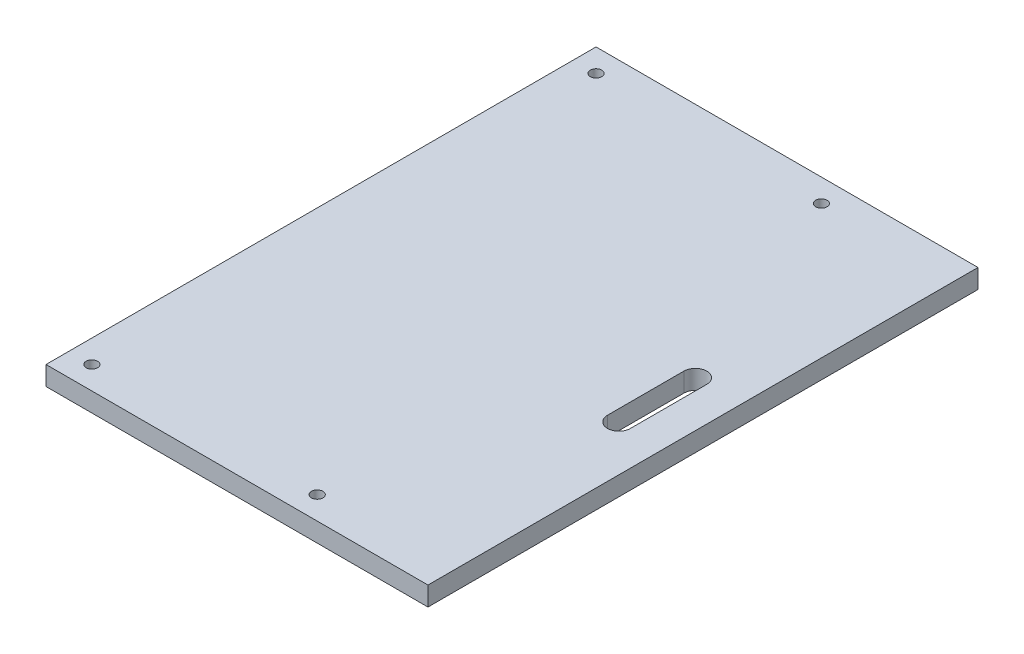
ISO-10303-21;
HEADER;
FILE_DESCRIPTION(('STEP AP214'),'2;1');
FILE_NAME('part.step','',(''),(''),'','','');
FILE_SCHEMA(('AUTOMOTIVE_DESIGN { 1 0 10303 214 1 1 1 1 }'));
ENDSEC;
DATA;
#1=APPLICATION_CONTEXT('core data for automotive mechanical design processes');
#2=APPLICATION_PROTOCOL_DEFINITION('international standard','automotive_design',2000,#1);
#3=PRODUCT_CONTEXT('',#1,'mechanical');
#4=PRODUCT('Part','Part','',(#3));
#5=PRODUCT_RELATED_PRODUCT_CATEGORY('part','',(#4));
#6=PRODUCT_DEFINITION_FORMATION('','',#4);
#7=PRODUCT_DEFINITION_CONTEXT('part definition',#1,'design');
#8=PRODUCT_DEFINITION('design','',#6,#7);
#9=PRODUCT_DEFINITION_SHAPE('','',#8);
#10=(LENGTH_UNIT() NAMED_UNIT(*) SI_UNIT(.MILLI.,.METRE.));
#11=(NAMED_UNIT(*) PLANE_ANGLE_UNIT() SI_UNIT($,.RADIAN.));
#12=(NAMED_UNIT(*) SI_UNIT($,.STERADIAN.) SOLID_ANGLE_UNIT());
#13=UNCERTAINTY_MEASURE_WITH_UNIT(LENGTH_MEASURE(1.E-05),#10,'distance_accuracy_value','');
#14=(GEOMETRIC_REPRESENTATION_CONTEXT(3) GLOBAL_UNCERTAINTY_ASSIGNED_CONTEXT((#13)) GLOBAL_UNIT_ASSIGNED_CONTEXT((#10,
#11,#12)) REPRESENTATION_CONTEXT('',''));
#15=CARTESIAN_POINT('',(0.,0.,0.));
#16=DIRECTION('',(0.,0.,1.));
#17=DIRECTION('',(1.,0.,0.));
#18=AXIS2_PLACEMENT_3D('',#15,#16,#17);
#19=CARTESIAN_POINT('',(0.,5.,0.));
#20=DIRECTION('',(0.,-1.,0.));
#21=DIRECTION('',(0.,0.,-1.));
#22=AXIS2_PLACEMENT_3D('',#19,#20,#21);
#23=PLANE('',#22);
#24=CARTESIAN_POINT('',(65.,5.,-6.));
#25=DIRECTION('',(0.,1.,0.));
#26=DIRECTION('',(0.,0.,1.));
#27=AXIS2_PLACEMENT_3D('',#24,#25,#26);
#28=CIRCLE('',#27,1.5);
#29=CARTESIAN_POINT('',(65.,5.,-4.5));
#30=VERTEX_POINT('',#29);
#31=EDGE_CURVE('E237',#30,#30,#28,.T.);
#32=ORIENTED_EDGE('',*,*,#31,.F.);
#33=EDGE_LOOP('',(#32));
#34=FACE_BOUND('',#33,.T.);
#35=CARTESIAN_POINT('',(65.,5.,-138.));
#36=DIRECTION('',(0.,1.,0.));
#37=DIRECTION('',(0.,0.,1.));
#38=AXIS2_PLACEMENT_3D('',#35,#36,#37);
#39=CIRCLE('',#38,1.5);
#40=CARTESIAN_POINT('',(65.,5.,-136.5));
#41=VERTEX_POINT('',#40);
#42=EDGE_CURVE('E239',#41,#41,#39,.T.);
#43=ORIENTED_EDGE('',*,*,#42,.F.);
#44=EDGE_LOOP('',(#43));
#45=FACE_BOUND('',#44,.T.);
#46=CARTESIAN_POINT('',(6.,5.,-6.));
#47=DIRECTION('',(0.,1.,0.));
#48=DIRECTION('',(0.,0.,1.));
#49=AXIS2_PLACEMENT_3D('',#46,#47,#48);
#50=CIRCLE('',#49,1.5);
#51=CARTESIAN_POINT('',(6.,5.,-4.5));
#52=VERTEX_POINT('',#51);
#53=EDGE_CURVE('E245',#52,#52,#50,.T.);
#54=ORIENTED_EDGE('',*,*,#53,.F.);
#55=EDGE_LOOP('',(#54));
#56=FACE_BOUND('',#55,.T.);
#57=CARTESIAN_POINT('',(6.,5.,-138.));
#58=DIRECTION('',(0.,1.,0.));
#59=DIRECTION('',(0.,0.,1.));
#60=AXIS2_PLACEMENT_3D('',#57,#58,#59);
#61=CIRCLE('',#60,1.5);
#62=CARTESIAN_POINT('',(6.,5.,-136.5));
#63=VERTEX_POINT('',#62);
#64=EDGE_CURVE('E251',#63,#63,#61,.T.);
#65=ORIENTED_EDGE('',*,*,#64,.F.);
#66=EDGE_LOOP('',(#65));
#67=FACE_BOUND('',#66,.T.);
#68=DIRECTION('',(0.,0.,1.));
#69=VECTOR('',#68,1.);
#70=CARTESIAN_POINT('',(0.,5.,0.));
#71=LINE('',#70,#69);
#72=CARTESIAN_POINT('',(0.,5.,-144.));
#73=VERTEX_POINT('',#72);
#74=CARTESIAN_POINT('',(0.,5.,0.));
#75=VERTEX_POINT('',#74);
#76=EDGE_CURVE('E135',#73,#75,#71,.T.);
#77=ORIENTED_EDGE('',*,*,#76,.T.);
#78=DIRECTION('',(1.,0.,0.));
#79=VECTOR('',#78,1.);
#80=CARTESIAN_POINT('',(0.,5.,0.));
#81=LINE('',#80,#79);
#82=CARTESIAN_POINT('',(100.,5.,0.));
#83=VERTEX_POINT('',#82);
#84=EDGE_CURVE('E138',#75,#83,#81,.T.);
#85=ORIENTED_EDGE('',*,*,#84,.T.);
#86=DIRECTION('',(0.,0.,-1.));
#87=VECTOR('',#86,1.);
#88=CARTESIAN_POINT('',(100.,5.,0.));
#89=LINE('',#88,#87);
#90=CARTESIAN_POINT('',(100.,5.,-144.));
#91=VERTEX_POINT('',#90);
#92=EDGE_CURVE('E141',#83,#91,#89,.T.);
#93=ORIENTED_EDGE('',*,*,#92,.T.);
#94=DIRECTION('',(-1.,0.,0.));
#95=VECTOR('',#94,1.);
#96=CARTESIAN_POINT('',(0.,5.,-144.));
#97=LINE('',#96,#95);
#98=EDGE_CURVE('E143',#91,#73,#97,.T.);
#99=ORIENTED_EDGE('',*,*,#98,.T.);
#100=EDGE_LOOP('',(#77,#85,#93,#99));
#101=FACE_BOUND('',#100,.T.);
#102=CARTESIAN_POINT('',(88.,5.,-82.));
#103=DIRECTION('',(0.,1.,0.));
#104=DIRECTION('',(0.,0.,1.));
#105=AXIS2_PLACEMENT_3D('',#102,#103,#104);
#106=CIRCLE('',#105,3.);
#107=CARTESIAN_POINT('',(91.,5.,-82.));
#108=VERTEX_POINT('',#107);
#109=CARTESIAN_POINT('',(85.,5.,-82.));
#110=VERTEX_POINT('',#109);
#111=EDGE_CURVE('E97',#108,#110,#106,.T.);
#112=ORIENTED_EDGE('',*,*,#111,.F.);
#113=DIRECTION('',(0.,0.,-1.));
#114=VECTOR('',#113,1.);
#115=CARTESIAN_POINT('',(91.,5.,-82.));
#116=LINE('',#115,#114);
#117=CARTESIAN_POINT('',(91.,5.,-62.));
#118=VERTEX_POINT('',#117);
#119=EDGE_CURVE('E119',#118,#108,#116,.T.);
#120=ORIENTED_EDGE('',*,*,#119,.F.);
#121=CARTESIAN_POINT('',(88.,5.,-62.));
#122=DIRECTION('',(0.,1.,0.));
#123=DIRECTION('',(0.,0.,-1.));
#124=AXIS2_PLACEMENT_3D('',#121,#122,#123);
#125=CIRCLE('',#124,3.);
#126=CARTESIAN_POINT('',(85.,5.,-62.));
#127=VERTEX_POINT('',#126);
#128=EDGE_CURVE('E117',#127,#118,#125,.T.);
#129=ORIENTED_EDGE('',*,*,#128,.F.);
#130=DIRECTION('',(0.,0.,1.));
#131=VECTOR('',#130,1.);
#132=CARTESIAN_POINT('',(85.,5.,-82.));
#133=LINE('',#132,#131);
#134=EDGE_CURVE('E105',#110,#127,#133,.T.);
#135=ORIENTED_EDGE('',*,*,#134,.F.);
#136=EDGE_LOOP('',(#112,#120,#129,#135));
#137=FACE_BOUND('',#136,.T.);
#138=ADVANCED_FACE('F32',(#34,#45,#56,#67,#101,#137),#23,.F.);
#139=CARTESIAN_POINT('',(0.,0.,0.));
#140=DIRECTION('',(0.,-1.,0.));
#141=DIRECTION('',(0.,0.,-1.));
#142=AXIS2_PLACEMENT_3D('',#139,#140,#141);
#143=PLANE('',#142);
#144=CARTESIAN_POINT('',(65.,0.,-6.));
#145=DIRECTION('',(0.,1.,0.));
#146=DIRECTION('',(0.,0.,1.));
#147=AXIS2_PLACEMENT_3D('',#144,#145,#146);
#148=CIRCLE('',#147,1.5);
#149=CARTESIAN_POINT('',(65.,0.,-4.5));
#150=VERTEX_POINT('',#149);
#151=EDGE_CURVE('E235',#150,#150,#148,.T.);
#152=ORIENTED_EDGE('',*,*,#151,.T.);
#153=EDGE_LOOP('',(#152));
#154=FACE_BOUND('',#153,.T.);
#155=CARTESIAN_POINT('',(65.,0.,-138.));
#156=DIRECTION('',(0.,1.,0.));
#157=DIRECTION('',(0.,0.,1.));
#158=AXIS2_PLACEMENT_3D('',#155,#156,#157);
#159=CIRCLE('',#158,1.5);
#160=CARTESIAN_POINT('',(65.,0.,-136.5));
#161=VERTEX_POINT('',#160);
#162=EDGE_CURVE('E242',#161,#161,#159,.T.);
#163=ORIENTED_EDGE('',*,*,#162,.T.);
#164=EDGE_LOOP('',(#163));
#165=FACE_BOUND('',#164,.T.);
#166=CARTESIAN_POINT('',(6.,0.,-6.));
#167=DIRECTION('',(0.,1.,0.));
#168=DIRECTION('',(0.,0.,1.));
#169=AXIS2_PLACEMENT_3D('',#166,#167,#168);
#170=CIRCLE('',#169,1.5);
#171=CARTESIAN_POINT('',(6.,0.,-4.5));
#172=VERTEX_POINT('',#171);
#173=EDGE_CURVE('E248',#172,#172,#170,.T.);
#174=ORIENTED_EDGE('',*,*,#173,.T.);
#175=EDGE_LOOP('',(#174));
#176=FACE_BOUND('',#175,.T.);
#177=CARTESIAN_POINT('',(6.,0.,-138.));
#178=DIRECTION('',(0.,1.,0.));
#179=DIRECTION('',(0.,0.,1.));
#180=AXIS2_PLACEMENT_3D('',#177,#178,#179);
#181=CIRCLE('',#180,1.5);
#182=CARTESIAN_POINT('',(6.,0.,-136.5));
#183=VERTEX_POINT('',#182);
#184=EDGE_CURVE('E125',#183,#183,#181,.T.);
#185=ORIENTED_EDGE('',*,*,#184,.T.);
#186=EDGE_LOOP('',(#185));
#187=FACE_BOUND('',#186,.T.);
#188=DIRECTION('',(0.,0.,1.));
#189=VECTOR('',#188,1.);
#190=CARTESIAN_POINT('',(0.,0.,0.));
#191=LINE('',#190,#189);
#192=CARTESIAN_POINT('',(0.,0.,-144.));
#193=VERTEX_POINT('',#192);
#194=CARTESIAN_POINT('',(0.,0.,0.));
#195=VERTEX_POINT('',#194);
#196=EDGE_CURVE('E113',#193,#195,#191,.T.);
#197=ORIENTED_EDGE('',*,*,#196,.F.);
#198=DIRECTION('',(-1.,0.,0.));
#199=VECTOR('',#198,1.);
#200=CARTESIAN_POINT('',(0.,0.,-144.));
#201=LINE('',#200,#199);
#202=CARTESIAN_POINT('',(100.,0.,-144.));
#203=VERTEX_POINT('',#202);
#204=EDGE_CURVE('E139',#203,#193,#201,.T.);
#205=ORIENTED_EDGE('',*,*,#204,.F.);
#206=DIRECTION('',(0.,0.,-1.));
#207=VECTOR('',#206,1.);
#208=CARTESIAN_POINT('',(100.,0.,0.));
#209=LINE('',#208,#207);
#210=CARTESIAN_POINT('',(100.,0.,0.));
#211=VERTEX_POINT('',#210);
#212=EDGE_CURVE('E150',#211,#203,#209,.T.);
#213=ORIENTED_EDGE('',*,*,#212,.F.);
#214=DIRECTION('',(1.,0.,0.));
#215=VECTOR('',#214,1.);
#216=CARTESIAN_POINT('',(0.,0.,0.));
#217=LINE('',#216,#215);
#218=EDGE_CURVE('E148',#195,#211,#217,.T.);
#219=ORIENTED_EDGE('',*,*,#218,.F.);
#220=EDGE_LOOP('',(#197,#205,#213,#219));
#221=FACE_BOUND('',#220,.T.);
#222=DIRECTION('',(0.,0.,-1.));
#223=VECTOR('',#222,1.);
#224=CARTESIAN_POINT('',(91.,0.,-82.));
#225=LINE('',#224,#223);
#226=CARTESIAN_POINT('',(91.,0.,-62.));
#227=VERTEX_POINT('',#226);
#228=CARTESIAN_POINT('',(91.,0.,-82.));
#229=VERTEX_POINT('',#228);
#230=EDGE_CURVE('E106',#227,#229,#225,.T.);
#231=ORIENTED_EDGE('',*,*,#230,.T.);
#232=CARTESIAN_POINT('',(88.,0.,-82.));
#233=DIRECTION('',(0.,1.,0.));
#234=DIRECTION('',(0.,0.,1.));
#235=AXIS2_PLACEMENT_3D('',#232,#233,#234);
#236=CIRCLE('',#235,3.);
#237=CARTESIAN_POINT('',(85.,0.,-82.));
#238=VERTEX_POINT('',#237);
#239=EDGE_CURVE('E55',#229,#238,#236,.T.);
#240=ORIENTED_EDGE('',*,*,#239,.T.);
#241=DIRECTION('',(0.,0.,1.));
#242=VECTOR('',#241,1.);
#243=CARTESIAN_POINT('',(85.,0.,-82.));
#244=LINE('',#243,#242);
#245=CARTESIAN_POINT('',(85.,0.,-62.));
#246=VERTEX_POINT('',#245);
#247=EDGE_CURVE('E112',#238,#246,#244,.T.);
#248=ORIENTED_EDGE('',*,*,#247,.T.);
#249=CARTESIAN_POINT('',(88.,0.,-62.));
#250=DIRECTION('',(0.,1.,0.));
#251=DIRECTION('',(0.,0.,-1.));
#252=AXIS2_PLACEMENT_3D('',#249,#250,#251);
#253=CIRCLE('',#252,3.);
#254=EDGE_CURVE('E127',#246,#227,#253,.T.);
#255=ORIENTED_EDGE('',*,*,#254,.T.);
#256=EDGE_LOOP('',(#231,#240,#248,#255));
#257=FACE_BOUND('',#256,.T.);
#258=ADVANCED_FACE('F168',(#154,#165,#176,#187,#221,#257),#143,.T.);
#259=CARTESIAN_POINT('',(0.,5.,0.));
#260=DIRECTION('',(1.,0.,0.));
#261=DIRECTION('',(0.,0.,-1.));
#262=AXIS2_PLACEMENT_3D('',#259,#260,#261);
#263=PLANE('',#262);
#264=ORIENTED_EDGE('',*,*,#196,.T.);
#265=DIRECTION('',(0.,-1.,0.));
#266=VECTOR('',#265,1.);
#267=CARTESIAN_POINT('',(0.,5.,0.));
#268=LINE('',#267,#266);
#269=EDGE_CURVE('E11',#75,#195,#268,.T.);
#270=ORIENTED_EDGE('',*,*,#269,.F.);
#271=ORIENTED_EDGE('',*,*,#76,.F.);
#272=DIRECTION('',(0.,-1.,0.));
#273=VECTOR('',#272,1.);
#274=CARTESIAN_POINT('',(0.,5.,-144.));
#275=LINE('',#274,#273);
#276=EDGE_CURVE('E145',#73,#193,#275,.T.);
#277=ORIENTED_EDGE('',*,*,#276,.T.);
#278=EDGE_LOOP('',(#264,#270,#271,#277));
#279=FACE_BOUND('',#278,.T.);
#280=ADVANCED_FACE('F34',(#279),#263,.F.);
#281=CARTESIAN_POINT('',(0.,5.,0.));
#282=DIRECTION('',(0.,0.,-1.));
#283=DIRECTION('',(-1.,0.,0.));
#284=AXIS2_PLACEMENT_3D('',#281,#282,#283);
#285=PLANE('',#284);
#286=ORIENTED_EDGE('',*,*,#218,.T.);
#287=DIRECTION('',(0.,-1.,0.));
#288=VECTOR('',#287,1.);
#289=CARTESIAN_POINT('',(100.,5.,0.));
#290=LINE('',#289,#288);
#291=EDGE_CURVE('E40',#83,#211,#290,.T.);
#292=ORIENTED_EDGE('',*,*,#291,.F.);
#293=ORIENTED_EDGE('',*,*,#84,.F.);
#294=ORIENTED_EDGE('',*,*,#269,.T.);
#295=EDGE_LOOP('',(#286,#292,#293,#294));
#296=FACE_BOUND('',#295,.T.);
#297=ADVANCED_FACE('F178',(#296),#285,.F.);
#298=CARTESIAN_POINT('',(100.,5.,0.));
#299=DIRECTION('',(-1.,0.,0.));
#300=DIRECTION('',(0.,0.,1.));
#301=AXIS2_PLACEMENT_3D('',#298,#299,#300);
#302=PLANE('',#301);
#303=ORIENTED_EDGE('',*,*,#212,.T.);
#304=DIRECTION('',(0.,-1.,0.));
#305=VECTOR('',#304,1.);
#306=CARTESIAN_POINT('',(100.,5.,-144.));
#307=LINE('',#306,#305);
#308=EDGE_CURVE('E155',#91,#203,#307,.T.);
#309=ORIENTED_EDGE('',*,*,#308,.F.);
#310=ORIENTED_EDGE('',*,*,#92,.F.);
#311=ORIENTED_EDGE('',*,*,#291,.T.);
#312=EDGE_LOOP('',(#303,#309,#310,#311));
#313=FACE_BOUND('',#312,.T.);
#314=ADVANCED_FACE('F162',(#313),#302,.F.);
#315=CARTESIAN_POINT('',(0.,5.,-144.));
#316=DIRECTION('',(0.,0.,1.));
#317=DIRECTION('',(1.,0.,0.));
#318=AXIS2_PLACEMENT_3D('',#315,#316,#317);
#319=PLANE('',#318);
#320=ORIENTED_EDGE('',*,*,#204,.T.);
#321=ORIENTED_EDGE('',*,*,#276,.F.);
#322=ORIENTED_EDGE('',*,*,#98,.F.);
#323=ORIENTED_EDGE('',*,*,#308,.T.);
#324=EDGE_LOOP('',(#320,#321,#322,#323));
#325=FACE_BOUND('',#324,.T.);
#326=ADVANCED_FACE('F172',(#325),#319,.F.);
#327=CARTESIAN_POINT('',(88.,5.,-82.));
#328=DIRECTION('',(0.,-1.,0.));
#329=DIRECTION('',(0.,0.,-1.));
#330=AXIS2_PLACEMENT_3D('',#327,#328,#329);
#331=CYLINDRICAL_SURFACE('',#330,3.);
#332=ORIENTED_EDGE('',*,*,#239,.F.);
#333=DIRECTION('',(0.,-1.,0.));
#334=VECTOR('',#333,1.);
#335=CARTESIAN_POINT('',(91.,5.,-82.));
#336=LINE('',#335,#334);
#337=EDGE_CURVE('E101',#108,#229,#336,.T.);
#338=ORIENTED_EDGE('',*,*,#337,.F.);
#339=ORIENTED_EDGE('',*,*,#111,.T.);
#340=DIRECTION('',(0.,-1.,0.));
#341=VECTOR('',#340,1.);
#342=CARTESIAN_POINT('',(85.,5.,-82.));
#343=LINE('',#342,#341);
#344=EDGE_CURVE('E100',#110,#238,#343,.T.);
#345=ORIENTED_EDGE('',*,*,#344,.T.);
#346=EDGE_LOOP('',(#332,#338,#339,#345));
#347=FACE_BOUND('',#346,.T.);
#348=ADVANCED_FACE('F99',(#347),#331,.F.);
#349=CARTESIAN_POINT('',(85.,5.,-82.));
#350=DIRECTION('',(1.,0.,0.));
#351=DIRECTION('',(0.,0.,-1.));
#352=AXIS2_PLACEMENT_3D('',#349,#350,#351);
#353=PLANE('',#352);
#354=ORIENTED_EDGE('',*,*,#247,.F.);
#355=ORIENTED_EDGE('',*,*,#344,.F.);
#356=ORIENTED_EDGE('',*,*,#134,.T.);
#357=DIRECTION('',(0.,-1.,0.));
#358=VECTOR('',#357,1.);
#359=CARTESIAN_POINT('',(85.,5.,-62.));
#360=LINE('',#359,#358);
#361=EDGE_CURVE('E114',#127,#246,#360,.T.);
#362=ORIENTED_EDGE('',*,*,#361,.T.);
#363=EDGE_LOOP('',(#354,#355,#356,#362));
#364=FACE_BOUND('',#363,.T.);
#365=ADVANCED_FACE('F109',(#364),#353,.T.);
#366=CARTESIAN_POINT('',(88.,5.,-62.));
#367=DIRECTION('',(0.,-1.,0.));
#368=DIRECTION('',(0.,0.,-1.));
#369=AXIS2_PLACEMENT_3D('',#366,#367,#368);
#370=CYLINDRICAL_SURFACE('',#369,3.);
#371=ORIENTED_EDGE('',*,*,#254,.F.);
#372=ORIENTED_EDGE('',*,*,#361,.F.);
#373=ORIENTED_EDGE('',*,*,#128,.T.);
#374=DIRECTION('',(0.,-1.,0.));
#375=VECTOR('',#374,1.);
#376=CARTESIAN_POINT('',(91.,5.,-62.));
#377=LINE('',#376,#375);
#378=EDGE_CURVE('E47',#118,#227,#377,.T.);
#379=ORIENTED_EDGE('',*,*,#378,.T.);
#380=EDGE_LOOP('',(#371,#372,#373,#379));
#381=FACE_BOUND('',#380,.T.);
#382=ADVANCED_FACE('F205',(#381),#370,.F.);
#383=CARTESIAN_POINT('',(91.,5.,-82.));
#384=DIRECTION('',(-1.,0.,0.));
#385=DIRECTION('',(0.,0.,1.));
#386=AXIS2_PLACEMENT_3D('',#383,#384,#385);
#387=PLANE('',#386);
#388=ORIENTED_EDGE('',*,*,#230,.F.);
#389=ORIENTED_EDGE('',*,*,#378,.F.);
#390=ORIENTED_EDGE('',*,*,#119,.T.);
#391=ORIENTED_EDGE('',*,*,#337,.T.);
#392=EDGE_LOOP('',(#388,#389,#390,#391));
#393=FACE_BOUND('',#392,.T.);
#394=ADVANCED_FACE('F209',(#393),#387,.T.);
#395=CARTESIAN_POINT('',(6.,0.,-138.));
#396=DIRECTION('',(0.,1.,0.));
#397=DIRECTION('',(0.,0.,1.));
#398=AXIS2_PLACEMENT_3D('',#395,#396,#397);
#399=CYLINDRICAL_SURFACE('',#398,1.5);
#400=ORIENTED_EDGE('',*,*,#184,.F.);
#401=EDGE_LOOP('',(#400));
#402=FACE_BOUND('',#401,.T.);
#403=ORIENTED_EDGE('',*,*,#64,.T.);
#404=EDGE_LOOP('',(#403));
#405=FACE_BOUND('',#404,.T.);
#406=ADVANCED_FACE('F215',(#402,#405),#399,.F.);
#407=CARTESIAN_POINT('',(6.,0.,-6.));
#408=DIRECTION('',(0.,1.,0.));
#409=DIRECTION('',(0.,0.,1.));
#410=AXIS2_PLACEMENT_3D('',#407,#408,#409);
#411=CYLINDRICAL_SURFACE('',#410,1.5);
#412=ORIENTED_EDGE('',*,*,#173,.F.);
#413=EDGE_LOOP('',(#412));
#414=FACE_BOUND('',#413,.T.);
#415=ORIENTED_EDGE('',*,*,#53,.T.);
#416=EDGE_LOOP('',(#415));
#417=FACE_BOUND('',#416,.T.);
#418=ADVANCED_FACE('F218',(#414,#417),#411,.F.);
#419=CARTESIAN_POINT('',(65.,0.,-138.));
#420=DIRECTION('',(0.,1.,0.));
#421=DIRECTION('',(0.,0.,1.));
#422=AXIS2_PLACEMENT_3D('',#419,#420,#421);
#423=CYLINDRICAL_SURFACE('',#422,1.5);
#424=ORIENTED_EDGE('',*,*,#162,.F.);
#425=EDGE_LOOP('',(#424));
#426=FACE_BOUND('',#425,.T.);
#427=ORIENTED_EDGE('',*,*,#42,.T.);
#428=EDGE_LOOP('',(#427));
#429=FACE_BOUND('',#428,.T.);
#430=ADVANCED_FACE('F222',(#426,#429),#423,.F.);
#431=CARTESIAN_POINT('',(65.,0.,-6.));
#432=DIRECTION('',(0.,1.,0.));
#433=DIRECTION('',(0.,0.,1.));
#434=AXIS2_PLACEMENT_3D('',#431,#432,#433);
#435=CYLINDRICAL_SURFACE('',#434,1.5);
#436=ORIENTED_EDGE('',*,*,#151,.F.);
#437=EDGE_LOOP('',(#436));
#438=FACE_BOUND('',#437,.T.);
#439=ORIENTED_EDGE('',*,*,#31,.T.);
#440=EDGE_LOOP('',(#439));
#441=FACE_BOUND('',#440,.T.);
#442=ADVANCED_FACE('F226',(#438,#441),#435,.F.);
#443=CLOSED_SHELL('',(#138,#258,#280,#297,#314,#326,#348,#365,#382,#394,#406,#418,#430,#442));
#444=MANIFOLD_SOLID_BREP('B2',#443);
#445=ADVANCED_BREP_SHAPE_REPRESENTATION('',(#18,#444),#14);
#446=SHAPE_DEFINITION_REPRESENTATION(#9,#445);
ENDSEC;
END-ISO-10303-21;
